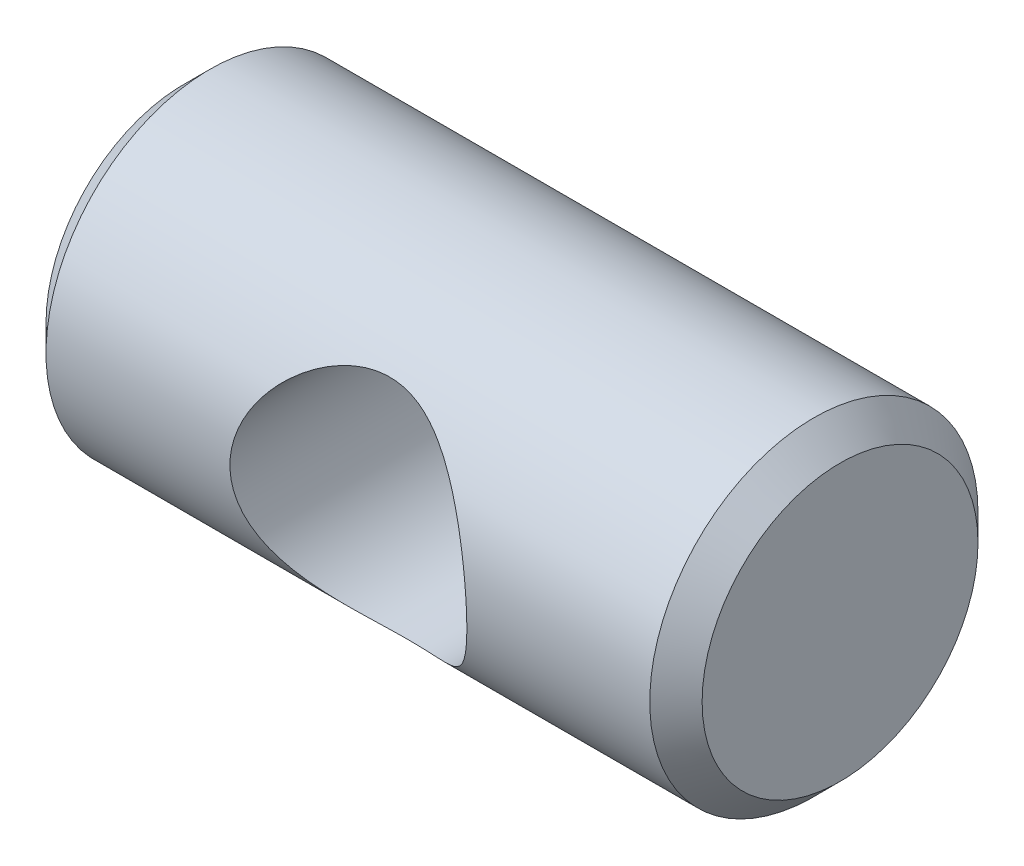
ISO-10303-21;
HEADER;
FILE_DESCRIPTION(('STEP AP214'),'2;1');
FILE_NAME('part.step','',(''),(''),'','','');
FILE_SCHEMA(('AUTOMOTIVE_DESIGN { 1 0 10303 214 1 1 1 1 }'));
ENDSEC;
DATA;
#1=APPLICATION_CONTEXT('core data for automotive mechanical design processes');
#2=APPLICATION_PROTOCOL_DEFINITION('international standard','automotive_design',2000,#1);
#3=PRODUCT_CONTEXT('',#1,'mechanical');
#4=PRODUCT('Part','Part','',(#3));
#5=PRODUCT_RELATED_PRODUCT_CATEGORY('part','',(#4));
#6=PRODUCT_DEFINITION_FORMATION('','',#4);
#7=PRODUCT_DEFINITION_CONTEXT('part definition',#1,'design');
#8=PRODUCT_DEFINITION('design','',#6,#7);
#9=PRODUCT_DEFINITION_SHAPE('','',#8);
#10=(LENGTH_UNIT() NAMED_UNIT(*) SI_UNIT(.MILLI.,.METRE.));
#11=(NAMED_UNIT(*) PLANE_ANGLE_UNIT() SI_UNIT($,.RADIAN.));
#12=(NAMED_UNIT(*) SI_UNIT($,.STERADIAN.) SOLID_ANGLE_UNIT());
#13=UNCERTAINTY_MEASURE_WITH_UNIT(LENGTH_MEASURE(1.E-05),#10,'distance_accuracy_value','');
#14=(GEOMETRIC_REPRESENTATION_CONTEXT(3) GLOBAL_UNCERTAINTY_ASSIGNED_CONTEXT((#13)) GLOBAL_UNIT_ASSIGNED_CONTEXT((#10,
#11,#12)) REPRESENTATION_CONTEXT('',''));
#15=CARTESIAN_POINT('',(0.,0.,0.));
#16=DIRECTION('',(0.,0.,1.));
#17=DIRECTION('',(1.,0.,0.));
#18=AXIS2_PLACEMENT_3D('',#15,#16,#17);
#19=CARTESIAN_POINT('',(9.525,0.,0.));
#20=DIRECTION('',(-1.,0.,0.));
#21=DIRECTION('',(0.,0.,1.));
#22=AXIS2_PLACEMENT_3D('',#19,#20,#21);
#23=CYLINDRICAL_SURFACE('',#22,4.765);
#24=CARTESIAN_POINT('',(3.42087708051605,0.,4.765));
#25=CARTESIAN_POINT('',(3.42696899134864,-0.0833627581168181,4.7649997101109));
#26=CARTESIAN_POINT('',(3.43001003086423,-0.166953392424251,4.76280757869707));
#27=CARTESIAN_POINT('',(3.4299899120654,-0.333933182408652,4.75402028790231));
#28=CARTESIAN_POINT('',(3.42692615604904,-0.41732223719261,4.74742325494959));
#29=CARTESIAN_POINT('',(3.41478160746824,-0.583312250165056,4.72989865727235));
#30=CARTESIAN_POINT('',(3.40569315136156,-0.665912068503747,4.71896558414041));
#31=CARTESIAN_POINT('',(3.38168739143667,-0.829610597514771,4.69295834085159));
#32=CARTESIAN_POINT('',(3.36676760565251,-0.91070865358331,4.67788240819801));
#33=CARTESIAN_POINT('',(3.31382161536753,-1.15000632689336,4.62699847385246));
#34=CARTESIAN_POINT('',(3.26752778272676,-1.30524951697123,4.58542013528299));
#35=CARTESIAN_POINT('',(3.15544383432779,-1.60411463212557,4.48962808746058));
#36=CARTESIAN_POINT('',(3.08965416222603,-1.74773682156028,4.43541466574349));
#37=CARTESIAN_POINT('',(2.93522566350036,-2.03259497643689,4.31273538578719));
#38=CARTESIAN_POINT('',(2.84518090003159,-2.17272279857911,4.24347672491827));
#39=CARTESIAN_POINT('',(2.64803347355049,-2.43631552731587,4.09784606286129));
#40=CARTESIAN_POINT('',(2.54091313456509,-2.55976291960052,4.02146672501527));
#41=CARTESIAN_POINT('',(2.28757037498761,-2.81327393100644,3.84950291536883));
#42=CARTESIAN_POINT('',(2.13784494064544,-2.93940806717613,3.75321839663728));
#43=CARTESIAN_POINT('',(1.89774924473951,-3.10885207016274,3.61188607024724));
#44=CARTESIAN_POINT('',(1.81509327318893,-3.16205944901992,3.56527135977744));
#45=CARTESIAN_POINT('',(1.64456461914389,-3.26165283895997,3.47438917550769));
#46=CARTESIAN_POINT('',(1.55669391813204,-3.30804141803447,3.43012082209569));
#47=CARTESIAN_POINT('',(1.33801732923479,-3.41144333221737,3.32784018306176));
#48=CARTESIAN_POINT('',(1.20454764001565,-3.46485738281701,3.27176419567389));
#49=CARTESIAN_POINT('',(0.927567219273259,-3.55539465585279,3.17315327144381));
#50=CARTESIAN_POINT('',(0.784080947165172,-3.59255605597934,3.13058666617785));
#51=CARTESIAN_POINT('',(0.514646140223209,-3.64343651296181,3.07113542283653));
#52=CARTESIAN_POINT('',(0.389980532152303,-3.66010628533956,3.05107413064414));
#53=CARTESIAN_POINT('',(0.13805144197163,-3.67954153570878,3.02761567970702));
#54=CARTESIAN_POINT('',(0.0107907379518652,-3.68232117171679,3.02420155283186));
#55=CARTESIAN_POINT('',(-0.242449329866106,-3.67376621747767,3.03458366659267));
#56=CARTESIAN_POINT('',(-0.368429244158409,-3.66243797397314,3.04837216824954));
#57=CARTESIAN_POINT('',(-0.615927376424317,-3.62657095184853,3.09094772918142));
#58=CARTESIAN_POINT('',(-0.737438661719832,-3.60201250089043,3.11975712134959));
#59=CARTESIAN_POINT('',(-1.02486117239319,-3.52797021750044,3.20358122773375));
#60=CARTESIAN_POINT('',(-1.18741075414518,-3.47231020523667,3.26453704351351));
#61=CARTESIAN_POINT('',(-1.498121783823,-3.34017866781708,3.39961296516166));
#62=CARTESIAN_POINT('',(-1.64623815847782,-3.2636446149314,3.47377238661047));
#63=CARTESIAN_POINT('',(-1.87825971607124,-3.12200897105521,3.60054284241464));
#64=CARTESIAN_POINT('',(-1.9664324955114,-3.06234750531042,3.65156363596668));
#65=CARTESIAN_POINT('',(-2.13658829521523,-2.93536296354977,3.75440484501345));
#66=CARTESIAN_POINT('',(-2.21856944344932,-2.86803758566651,3.80622549668558));
#67=CARTESIAN_POINT('',(-2.4548169203279,-2.65493557738645,3.96070606463684));
#68=CARTESIAN_POINT('',(-2.59972905493882,-2.49782379852181,4.06258137631192));
#69=CARTESIAN_POINT('',(-2.83706621766583,-2.18575837138569,4.23718725327564));
#70=CARTESIAN_POINT('',(-2.93424360521689,-2.03548298499758,4.31186637762032));
#71=CARTESIAN_POINT('',(-3.10568912436017,-1.71702572980925,4.44824656330391));
#72=CARTESIAN_POINT('',(-3.17999040299218,-1.54887024912961,4.50996636079322));
#73=CARTESIAN_POINT('',(-3.29263516387729,-1.22389848309853,4.60778480850806));
#74=CARTESIAN_POINT('',(-3.33468022800881,-1.06910753325384,4.64632732736096));
#75=CARTESIAN_POINT('',(-3.39687013419293,-0.752190984217973,4.70801774696666));
#76=CARTESIAN_POINT('',(-3.4170259792185,-0.590069112764689,4.73117337991453));
#77=CARTESIAN_POINT('',(-3.43390286080123,-0.262598143568305,4.7606051003247));
#78=CARTESIAN_POINT('',(-3.43055828056669,-0.0972412962651655,4.76683385814853));
#79=CARTESIAN_POINT('',(-3.40010195996678,0.231024129353292,4.76222706928004));
#80=CARTESIAN_POINT('',(-3.37298745129903,0.393932420256085,4.75138953488968));
#81=CARTESIAN_POINT('',(-3.29795083571309,0.705514268669748,4.71498049061455));
#82=CARTESIAN_POINT('',(-3.25098003249397,0.854498752183594,4.69006694126301));
#83=CARTESIAN_POINT('',(-3.13840780618742,1.14256413370517,4.62833634686259));
#84=CARTESIAN_POINT('',(-3.07280276883643,1.28164310390504,4.59151699239254));
#85=CARTESIAN_POINT('',(-2.91796402171938,1.5605913242394,4.50478911028579));
#86=CARTESIAN_POINT('',(-2.82706121692328,1.6992420339739,4.45396042558585));
#87=CARTESIAN_POINT('',(-2.62789389216064,1.96045324775842,4.34533105232053));
#88=CARTESIAN_POINT('',(-2.51961335554432,2.08299871660834,4.28752394420402));
#89=CARTESIAN_POINT('',(-2.26753986981794,2.33061071233595,4.15886196775128));
#90=CARTESIAN_POINT('',(-2.12084350362776,2.4524560274696,4.08747815085455));
#91=CARTESIAN_POINT('',(-1.80818256348861,2.67091966387117,3.94818744226299));
#92=CARTESIAN_POINT('',(-1.64221717999394,2.76753692468301,3.88028069682256));
#93=CARTESIAN_POINT('',(-1.32363316444147,2.91829752704228,3.76775877390234));
#94=CARTESIAN_POINT('',(-1.17388770573105,2.97693831230802,3.72114907301218));
#95=CARTESIAN_POINT('',(-0.941826581338292,3.04915600293589,3.66180847873486));
#96=CARTESIAN_POINT('',(-0.863255129060434,3.07060089781089,3.64379412637323));
#97=CARTESIAN_POINT('',(-0.703992654043788,3.10797188341903,3.61197174564401));
#98=CARTESIAN_POINT('',(-0.623302694735671,3.12390068817333,3.59816164910818));
#99=CARTESIAN_POINT('',(-0.459495462666015,3.15010468685879,3.57524455910332));
#100=CARTESIAN_POINT('',(-0.376361962516613,3.16032158062367,3.5661861203942));
#101=CARTESIAN_POINT('',(-0.209195138832911,3.17464168800661,3.55344451616001));
#102=CARTESIAN_POINT('',(-0.125162274904956,3.17874788699032,3.54975872585817));
#103=CARTESIAN_POINT('',(0.0430393452037649,3.18076053743013,3.54795587812489));
#104=CARTESIAN_POINT('',(0.127208095972434,3.17866722999483,3.54983860412504));
#105=CARTESIAN_POINT('',(0.294840628996078,3.16833758034575,3.55905933774995));
#106=CARTESIAN_POINT('',(0.378304441298765,3.16010150131517,3.56639711165655));
#107=CARTESIAN_POINT('',(0.604314657609783,3.129430196119,3.59341005189328));
#108=CARTESIAN_POINT('',(0.745494317394033,3.10101793603989,3.61818171011667));
#109=CARTESIAN_POINT('',(1.0206998312674,3.02771937958645,3.67972750014127));
#110=CARTESIAN_POINT('',(1.1547183301723,2.98281650470617,3.71651370639189));
#111=CARTESIAN_POINT('',(1.46853642894096,2.8560768918245,3.8153502491925));
#112=CARTESIAN_POINT('',(1.64398166227299,2.76664814536404,3.88152734494911));
#113=CARTESIAN_POINT('',(1.97551522842484,2.56077346334119,4.02033820070584));
#114=CARTESIAN_POINT('',(2.13156938380249,2.44428083509274,4.09298298410994));
#115=CARTESIAN_POINT('',(2.42421216807333,2.18450650401399,4.2373970566927));
#116=CARTESIAN_POINT('',(2.56052605726515,2.04090097393914,4.30914323590253));
#117=CARTESIAN_POINT('',(2.80802181758102,1.72973058522059,4.44318432752426));
#118=CARTESIAN_POINT('',(2.91923707314103,1.56219804304704,4.50549175797245));
#119=CARTESIAN_POINT('',(3.09396462152009,1.23969583506405,4.60338031575656));
#120=CARTESIAN_POINT('',(3.16252149709776,1.08834922542924,4.64178783933997));
#121=CARTESIAN_POINT('',(3.24875451241662,0.853387810710919,4.68864069192958));
#122=CARTESIAN_POINT('',(3.27471971164357,0.773800863355168,4.70245945854321));
#123=CARTESIAN_POINT('',(3.32087000112459,0.612411306870996,4.72618391319332));
#124=CARTESIAN_POINT('',(3.34105760799584,0.530609679466057,4.73609130567107));
#125=CARTESIAN_POINT('',(3.37353939001354,0.374335243630176,4.75084997254152));
#126=CARTESIAN_POINT('',(3.38645258471521,0.300030947704157,4.75613339853629));
#127=CARTESIAN_POINT('',(3.40736829831093,0.150546671086999,4.76320900575073));
#128=CARTESIAN_POINT('',(3.41536951590209,0.0753664637160971,4.76500026208246));
#129=CARTESIAN_POINT('',(3.42087708051605,0.,4.765));
#130=B_SPLINE_CURVE_WITH_KNOTS('',3,(#24,#25,#26,#27,#28,#29,#30,#31,#32,#33,#34,#35,#36,#37,
#38,#39,#40,#41,#42,#43,#44,#45,#46,#47,#48,#49,#50,#51,#52,#53,#54,#55,#56,#57,#58,#59,#60,#61,
#62,#63,#64,#65,#66,#67,#68,#69,#70,#71,#72,#73,#74,#75,#76,#77,#78,#79,#80,#81,#82,#83,#84,#85,
#86,#87,#88,#89,#90,#91,#92,#93,#94,#95,#96,#97,#98,#99,#100,#101,#102,#103,#104,#105,#106,#107,
#108,#109,#110,#111,#112,#113,#114,#115,#116,#117,#118,#119,#120,#121,#122,#123,#124,#125,#126,
#127,#128,#129),.UNSPECIFIED.,.T.,.F.,(4,2,2,2,2,2,2,2,2,2,2,2,2,2,2,2,2,2,2,2,2,2,2,2,2,2,2,2,
2,2,2,2,2,2,2,2,2,2,2,2,2,2,2,2,2,2,2,2,2,2,2,2,4),(0.,0.250678148817341,0.501462988541287,
0.752567445437252,1.00377889552888,1.50309474088369,2.00239922444642,2.54160992918404,
3.08138247258981,3.73300244855075,4.05909733145616,4.38506908912952,4.84654436743379,
5.30692973453839,5.68734604359481,6.06737452056514,6.44723209503533,6.82765605484285,
7.37157480546312,7.91714109472132,8.27090631470675,8.62477807035775,9.33119791439565,
9.91077027397038,10.4894988486046,10.9822712500665,11.4747958366297,11.9686961727678,
12.4626540373564,12.9352342359093,13.4079061579591,13.9261848288361,14.4449439577641,
15.0533142145202,15.6617100398795,16.1619385675779,16.4119146790501,16.6617676221917,
16.9141262556176,17.1663615593023,17.4185870532858,17.6708017414467,18.1072101440206,
18.5440584873629,19.1640002904501,19.7850197135797,20.4139885307568,21.0421157411608,
21.5513660687497,21.8056438515067,22.059810706191,22.2863833912941,22.5130160751694),.UNSPECIFIED.);
#131=CARTESIAN_POINT('',(3.42087708051605,0.,4.765));
#132=VERTEX_POINT('',#131);
#133=EDGE_CURVE('E48',#132,#132,#130,.T.);
#134=ORIENTED_EDGE('',*,*,#133,.T.);
#135=EDGE_LOOP('',(#134));
#136=FACE_BOUND('',#135,.T.);
#137=CARTESIAN_POINT('',(3.43,-0.25,-4.75843724346555));
#138=CARTESIAN_POINT('',(3.42999922787093,-0.166724112169052,-4.76281167621829));
#139=CARTESIAN_POINT('',(3.42696170981832,-0.0833091871232495,-4.76499730659661));
#140=CARTESIAN_POINT('',(3.4148068467804,0.0831121740296209,-4.7650026918208));
#141=CARTESIAN_POINT('',(3.40568584755888,0.166118334391627,-4.76281982101014));
#142=CARTESIAN_POINT('',(3.38143299325718,0.331186959790397,-4.75419585970188));
#143=CARTESIAN_POINT('',(3.36628998600944,0.413247381645857,-4.74774685395692));
#144=CARTESIAN_POINT('',(3.33018248201757,0.575663796690919,-4.7308054983668));
#145=CARTESIAN_POINT('',(3.30921546630946,0.656019036141792,-4.72031139819935));
#146=CARTESIAN_POINT('',(3.23819654976144,0.892787966377314,-4.68332033908369));
#147=CARTESIAN_POINT('',(3.17986930590837,1.04595137150619,-4.65125389258668));
#148=CARTESIAN_POINT('',(3.04361904551389,1.33984014973707,-4.57527843427846));
#149=CARTESIAN_POINT('',(2.96570051271122,1.48056835886066,-4.5313721320163));
#150=CARTESIAN_POINT('',(2.78614227044201,1.75788689740451,-4.43151908585651));
#151=CARTESIAN_POINT('',(2.68315702445496,1.89336529725831,-4.37491413457117));
#152=CARTESIAN_POINT('',(2.45967503555253,2.14655524443234,-4.25642076403591));
#153=CARTESIAN_POINT('',(2.33915597919725,2.26424375736879,-4.1945256545925));
#154=CARTESIAN_POINT('',(2.06004986641745,2.49954291256701,-4.05942448373215));
#155=CARTESIAN_POINT('',(1.89848678532065,2.61358783923186,-3.98612152048065));
#156=CARTESIAN_POINT('',(1.55552772477578,2.8134167940547,-3.84768475167639));
#157=CARTESIAN_POINT('',(1.37415171538823,2.8992289351292,-3.78254285998121));
#158=CARTESIAN_POINT('',(1.04249027419633,3.02121659224799,-3.68536960684574));
#159=CARTESIAN_POINT('',(0.896059930245661,3.06446847823432,-3.64913089405156));
#160=CARTESIAN_POINT('',(0.59599414502253,3.13130443601069,-3.59195313084763));
#161=CARTESIAN_POINT('',(0.442372589402984,3.15492488386826,-3.57098579230857));
#162=CARTESIAN_POINT('',(0.130968163534104,3.18107400515714,-3.54772325730842));
#163=CARTESIAN_POINT('',(-0.02683346636173,3.18348141023251,-3.54553541923722));
#164=CARTESIAN_POINT('',(-0.340378540732284,3.16668321345997,-3.56054009581889));
#165=CARTESIAN_POINT('',(-0.496120783126501,3.14746550747579,-3.57774346424277));
#166=CARTESIAN_POINT('',(-0.789904337023396,3.0909210961652,-3.62666135115865));
#167=CARTESIAN_POINT('',(-0.928415250197683,3.0549866148247,-3.65725103780534));
#168=CARTESIAN_POINT('',(-1.19751261050963,2.96728528802359,-3.72875878634848));
#169=CARTESIAN_POINT('',(-1.3280924753778,2.91550550146166,-3.76968528568752));
#170=CARTESIAN_POINT('',(-1.63782460440973,2.77052705474688,-3.87825771410624));
#171=CARTESIAN_POINT('',(-1.81191316545693,2.66921327673824,-3.9495685015488));
#172=CARTESIAN_POINT('',(-2.13907509935082,2.4387535532021,-4.09590072272998));
#173=CARTESIAN_POINT('',(-2.29211018589258,2.30955797140353,-4.17092858781235));
#174=CARTESIAN_POINT('',(-2.57575490113864,2.02402160906534,-4.31676779733467));
#175=CARTESIAN_POINT('',(-2.70617703034937,1.86747364912315,-4.38754097750563));
#176=CARTESIAN_POINT('',(-2.93894144764791,1.53024851972964,-4.51618771874562));
#177=CARTESIAN_POINT('',(-3.04134418612298,1.34962456620741,-4.57408899880651));
#178=CARTESIAN_POINT('',(-3.19328266988702,1.01242767734237,-4.65865916827853));
#179=CARTESIAN_POINT('',(-3.24956507034397,0.859923323449721,-4.68945201631652));
#180=CARTESIAN_POINT('',(-3.34025251275025,0.54635690282555,-4.73621910160439));
#181=CARTESIAN_POINT('',(-3.37467267483606,0.385300834260466,-4.75220358398007));
#182=CARTESIAN_POINT('',(-3.42008033355065,0.0585909892563579,-4.76745293508549));
#183=CARTESIAN_POINT('',(-3.43099500658852,-0.107075469726215,-4.76666592499011));
#184=CARTESIAN_POINT('',(-3.42886170148299,-0.43726352442702,-4.74777547003753));
#185=CARTESIAN_POINT('',(-3.41581144729144,-0.601785009912753,-4.72967038048901));
#186=CARTESIAN_POINT('',(-3.36811701365222,-0.917023455984579,-4.67852691536303));
#187=CARTESIAN_POINT('',(-3.33452146005276,-1.06802543846495,-4.64623395849401));
#188=CARTESIAN_POINT('',(-3.2486320258752,-1.36114282577409,-4.56897312306875));
#189=CARTESIAN_POINT('',(-3.19633384236941,-1.5032561767415,-4.52400232821754));
#190=CARTESIAN_POINT('',(-3.06961312822602,-1.78918123830801,-4.41920416422592));
#191=CARTESIAN_POINT('',(-2.99357734594169,-1.93190566387653,-4.35837989651049));
#192=CARTESIAN_POINT('',(-2.82452841204479,-2.20254689954151,-4.22807467175417));
#193=CARTESIAN_POINT('',(-2.73150417873574,-2.3304539546229,-4.15858807365445));
#194=CARTESIAN_POINT('',(-2.51111133608926,-2.59396805594881,-4.00055978130539));
#195=CARTESIAN_POINT('',(-2.38058009592622,-2.72627669731258,-3.9109325153004));
#196=CARTESIAN_POINT('',(-2.100243948315,-2.96812567159531,-3.73070877587188));
#197=CARTESIAN_POINT('',(-1.95042123769023,-3.07764472575725,-3.64011147895989));
#198=CARTESIAN_POINT('',(-1.65330676505374,-3.25959426369705,-3.47751484837525));
#199=CARTESIAN_POINT('',(-1.50833136837071,-3.33502083401562,-3.40464496946819));
#200=CARTESIAN_POINT('',(-1.20430907278381,-3.46586658517558,-3.2713441238456));
#201=CARTESIAN_POINT('',(-1.04529331737332,-3.52132872734755,-3.21088656913652));
#202=CARTESIAN_POINT('',(-0.757665304054353,-3.59765604252707,-3.124823861218));
#203=CARTESIAN_POINT('',(-0.631975559150282,-3.62377560920146,-3.09423907936361));
#204=CARTESIAN_POINT('',(-0.37572147065843,-3.66180814769204,-3.04914510271432));
#205=CARTESIAN_POINT('',(-0.245166515787296,-3.67374715513707,-3.03460645057289));
#206=CARTESIAN_POINT('',(0.0177966534529423,-3.68248381420053,-3.02400445245463));
#207=CARTESIAN_POINT('',(0.150210360703107,-3.67921741545453,-3.02801925946825));
#208=CARTESIAN_POINT('',(0.412078573372208,-3.65769938197026,-3.0539665857314));
#209=CARTESIAN_POINT('',(0.541528914164659,-3.63942784679228,-3.07592289956546));
#210=CARTESIAN_POINT('',(0.826729712346175,-3.58281700309049,-3.14180670904453));
#211=CARTESIAN_POINT('',(0.980691312065216,-3.54052764492096,-3.18993005386834));
#212=CARTESIAN_POINT('',(1.2767906566915,-3.43738681858182,-3.30080253377366));
#213=CARTESIAN_POINT('',(1.41889524108079,-3.37648537626474,-3.36359093675505));
#214=CARTESIAN_POINT('',(1.64936888169118,-3.25927230939949,-3.4766169791788));
#215=CARTESIAN_POINT('',(1.7409394575126,-3.20719498221027,-3.52486634365835));
#216=CARTESIAN_POINT('',(1.91819495195357,-3.09541954727663,-3.62341667346676));
#217=CARTESIAN_POINT('',(2.0038777780348,-3.03571875143679,-3.67371835818199));
#218=CARTESIAN_POINT('',(2.16931406665596,-2.90891804374965,-3.77491865704642));
#219=CARTESIAN_POINT('',(2.24906308395903,-2.84181267646787,-3.82581768629146));
#220=CARTESIAN_POINT('',(2.40236682455076,-2.70038920437342,-3.92691720618762));
#221=CARTESIAN_POINT('',(2.47592189315842,-2.62607150215374,-3.9771177356504));
#222=CARTESIAN_POINT('',(2.61724277483523,-2.46949972376397,-4.0762079661732));
#223=CARTESIAN_POINT('',(2.68493753880603,-2.38716864979552,-4.1250776725309));
#224=CARTESIAN_POINT('',(2.81310096557155,-2.21541256265412,-4.21980975535666));
#225=CARTESIAN_POINT('',(2.87356863036593,-2.1259865725645,-4.26567171608716));
#226=CARTESIAN_POINT('',(2.98645656939565,-1.94048293416798,-4.35318701528818));
#227=CARTESIAN_POINT('',(3.03889156631573,-1.8444179349447,-4.39484800441003));
#228=CARTESIAN_POINT('',(3.1349771488852,-1.64605779138663,-4.47292957405361));
#229=CARTESIAN_POINT('',(3.17863227184576,-1.54376590080899,-4.50935285855684));
#230=CARTESIAN_POINT('',(3.27242101077825,-1.28981920639204,-4.58975257088417));
#231=CARTESIAN_POINT('',(3.31773285408371,-1.1352862763967,-4.63059676914717));
#232=CARTESIAN_POINT('',(3.36922808334745,-0.897902839073422,-4.68033819384841));
#233=CARTESIAN_POINT('',(3.38364210754005,-0.817919413239365,-4.69498977614935));
#234=CARTESIAN_POINT('',(3.4067980569507,-0.656514982838962,-4.7202607906775));
#235=CARTESIAN_POINT('',(3.41554315786432,-0.575094809436487,-4.73088247904069));
#236=CARTESIAN_POINT('',(3.42423436805334,-0.452884075948466,-4.74360353870641));
#237=CARTESIAN_POINT('',(3.42639368476122,-0.412398045833621,-4.74729478081944));
#238=CARTESIAN_POINT('',(3.42927683030824,-0.331285742741574,-4.75364382663165));
#239=CARTESIAN_POINT('',(3.43000037699194,-0.29065944377002,-4.7563014271186));
#240=CARTESIAN_POINT('',(3.43,-0.25,-4.75843724346555));
#241=B_SPLINE_CURVE_WITH_KNOTS('',3,(#137,#138,#139,#140,#141,#142,#143,#144,#145,#146,#147,
#148,#149,#150,#151,#152,#153,#154,#155,#156,#157,#158,#159,#160,#161,#162,#163,#164,#165,#166,
#167,#168,#169,#170,#171,#172,#173,#174,#175,#176,#177,#178,#179,#180,#181,#182,#183,#184,#185,
#186,#187,#188,#189,#190,#191,#192,#193,#194,#195,#196,#197,#198,#199,#200,#201,#202,#203,#204,
#205,#206,#207,#208,#209,#210,#211,#212,#213,#214,#215,#216,#217,#218,#219,#220,#221,#222,#223,
#224,#225,#226,#227,#228,#229,#230,#231,#232,#233,#234,#235,#236,#237,#238,#239,#240),
.UNSPECIFIED.,.T.,.F.,(4,2,2,2,2,2,2,2,2,2,2,2,2,2,2,2,2,2,2,2,2,2,2,2,2,2,2,2,2,2,2,2,2,2,2,2,
2,2,2,2,2,2,2,2,2,2,2,2,2,2,2,4),(0.,0.250128749904401,0.500407883064132,0.751152683255352,
1.00200610335284,1.5005745207861,1.99902893760549,2.53506428284883,3.0717878497701,
3.7017577007417,4.33109834451233,4.80006775596797,5.26816624101772,5.73893897524922,
6.20997534433429,6.64735102377689,7.08508487226794,7.72280008470007,8.36166008801208,
9.005587331222,9.64811417987124,10.1423678843309,10.636279384842,11.1317189102055,
11.6272054919413,12.0992981890246,12.5714995707697,13.0879217874425,13.6046820813895,
14.2214259135372,14.8387430440107,15.373911233242,15.9079208139713,16.3022952653857,
16.6959445170977,17.0912534507832,17.4870875080064,17.9846304730142,18.483521274847,
18.8307287538683,19.1780590008212,19.5256468793742,19.8732153666977,20.2245350343439,
20.5759031603044,20.926619370564,21.2771538674155,21.7730640559323,22.0205706255638,
22.2679384234592,22.3900397673761,22.512165104096),.UNSPECIFIED.);
#242=CARTESIAN_POINT('',(3.43,-0.25,-4.75843724346555));
#243=VERTEX_POINT('',#242);
#244=EDGE_CURVE('E67',#243,#243,#241,.T.);
#245=ORIENTED_EDGE('',*,*,#244,.T.);
#246=EDGE_LOOP('',(#245));
#247=FACE_BOUND('',#246,.T.);
#248=CARTESIAN_POINT('',(-8.76499999999999,0.,0.));
#249=DIRECTION('',(1.,0.,0.));
#250=DIRECTION('',(0.,0.,-1.));
#251=AXIS2_PLACEMENT_3D('',#248,#249,#250);
#252=CIRCLE('',#251,4.765);
#253=CARTESIAN_POINT('',(-8.76499999999999,0.,-4.765));
#254=VERTEX_POINT('',#253);
#255=EDGE_CURVE('E64',#254,#254,#252,.T.);
#256=ORIENTED_EDGE('',*,*,#255,.T.);
#257=EDGE_LOOP('',(#256));
#258=FACE_BOUND('',#257,.T.);
#259=CARTESIAN_POINT('',(8.76500000000001,0.,0.));
#260=DIRECTION('',(1.,0.,0.));
#261=DIRECTION('',(0.,0.,-1.));
#262=AXIS2_PLACEMENT_3D('',#259,#260,#261);
#263=CIRCLE('',#262,4.765);
#264=CARTESIAN_POINT('',(8.76500000000001,0.,-4.765));
#265=VERTEX_POINT('',#264);
#266=EDGE_CURVE('E105',#265,#265,#263,.F.);
#267=ORIENTED_EDGE('',*,*,#266,.T.);
#268=EDGE_LOOP('',(#267));
#269=FACE_BOUND('',#268,.T.);
#270=ADVANCED_FACE('F43',(#136,#247,#258,#269),#23,.T.);
#271=CARTESIAN_POINT('',(9.525,0.,0.));
#272=DIRECTION('',(1.,0.,0.));
#273=DIRECTION('',(0.,0.,-1.));
#274=AXIS2_PLACEMENT_3D('',#271,#272,#273);
#275=PLANE('',#274);
#276=CARTESIAN_POINT('',(9.525,0.,0.));
#277=DIRECTION('',(1.,0.,0.));
#278=DIRECTION('',(0.,0.,-1.));
#279=AXIS2_PLACEMENT_3D('',#276,#277,#278);
#280=CIRCLE('',#279,4.00500000000001);
#281=CARTESIAN_POINT('',(9.525,0.,-4.00500000000001));
#282=VERTEX_POINT('',#281);
#283=EDGE_CURVE('E10',#282,#282,#280,.T.);
#284=ORIENTED_EDGE('',*,*,#283,.T.);
#285=EDGE_LOOP('',(#284));
#286=FACE_BOUND('',#285,.T.);
#287=ADVANCED_FACE('F80',(#286),#275,.T.);
#288=CARTESIAN_POINT('',(-9.525,0.,0.));
#289=DIRECTION('',(1.,0.,0.));
#290=DIRECTION('',(0.,0.,-1.));
#291=AXIS2_PLACEMENT_3D('',#288,#289,#290);
#292=PLANE('',#291);
#293=CARTESIAN_POINT('',(-9.525,0.,0.));
#294=DIRECTION('',(1.,0.,0.));
#295=DIRECTION('',(0.,0.,-1.));
#296=AXIS2_PLACEMENT_3D('',#293,#294,#295);
#297=CIRCLE('',#296,4.00499999999998);
#298=CARTESIAN_POINT('',(-9.525,0.,-4.00499999999998));
#299=VERTEX_POINT('',#298);
#300=EDGE_CURVE('E58',#299,#299,#297,.F.);
#301=ORIENTED_EDGE('',*,*,#300,.T.);
#302=EDGE_LOOP('',(#301));
#303=FACE_BOUND('',#302,.T.);
#304=ADVANCED_FACE('F83',(#303),#292,.F.);
#305=CARTESIAN_POINT('',(-8.76499999999999,0.,0.));
#306=DIRECTION('',(1.,0.,0.));
#307=DIRECTION('',(0.,0.,-1.));
#308=AXIS2_PLACEMENT_3D('',#305,#306,#307);
#309=CONICAL_SURFACE('',#308,4.765,0.785398163397451);
#310=ORIENTED_EDGE('',*,*,#300,.F.);
#311=EDGE_LOOP('',(#310));
#312=FACE_BOUND('',#311,.T.);
#313=ORIENTED_EDGE('',*,*,#255,.F.);
#314=EDGE_LOOP('',(#313));
#315=FACE_BOUND('',#314,.T.);
#316=ADVANCED_FACE('F85',(#312,#315),#309,.T.);
#317=CARTESIAN_POINT('',(9.525,0.,0.));
#318=DIRECTION('',(-1.,0.,0.));
#319=DIRECTION('',(0.,0.,1.));
#320=AXIS2_PLACEMENT_3D('',#317,#318,#319);
#321=CONICAL_SURFACE('',#320,4.00500000000001,0.785398163397448);
#322=ORIENTED_EDGE('',*,*,#266,.F.);
#323=EDGE_LOOP('',(#322));
#324=FACE_BOUND('',#323,.T.);
#325=ORIENTED_EDGE('',*,*,#283,.F.);
#326=EDGE_LOOP('',(#325));
#327=FACE_BOUND('',#326,.T.);
#328=ADVANCED_FACE('F46',(#324,#327),#321,.T.);
#329=CARTESIAN_POINT('',(0.,-0.25,-9.525));
#330=DIRECTION('',(0.,0.,1.));
#331=DIRECTION('',(1.,0.,0.));
#332=AXIS2_PLACEMENT_3D('',#329,#330,#331);
#333=CYLINDRICAL_SURFACE('',#332,3.43);
#334=ORIENTED_EDGE('',*,*,#244,.F.);
#335=EDGE_LOOP('',(#334));
#336=FACE_BOUND('',#335,.T.);
#337=ORIENTED_EDGE('',*,*,#133,.F.);
#338=EDGE_LOOP('',(#337));
#339=FACE_BOUND('',#338,.T.);
#340=ADVANCED_FACE('F75',(#336,#339),#333,.F.);
#341=CLOSED_SHELL('',(#270,#287,#304,#316,#328,#340));
#342=MANIFOLD_SOLID_BREP('B2',#341);
#343=ADVANCED_BREP_SHAPE_REPRESENTATION('',(#18,#342),#14);
#344=SHAPE_DEFINITION_REPRESENTATION(#9,#343);
ENDSEC;
END-ISO-10303-21;
